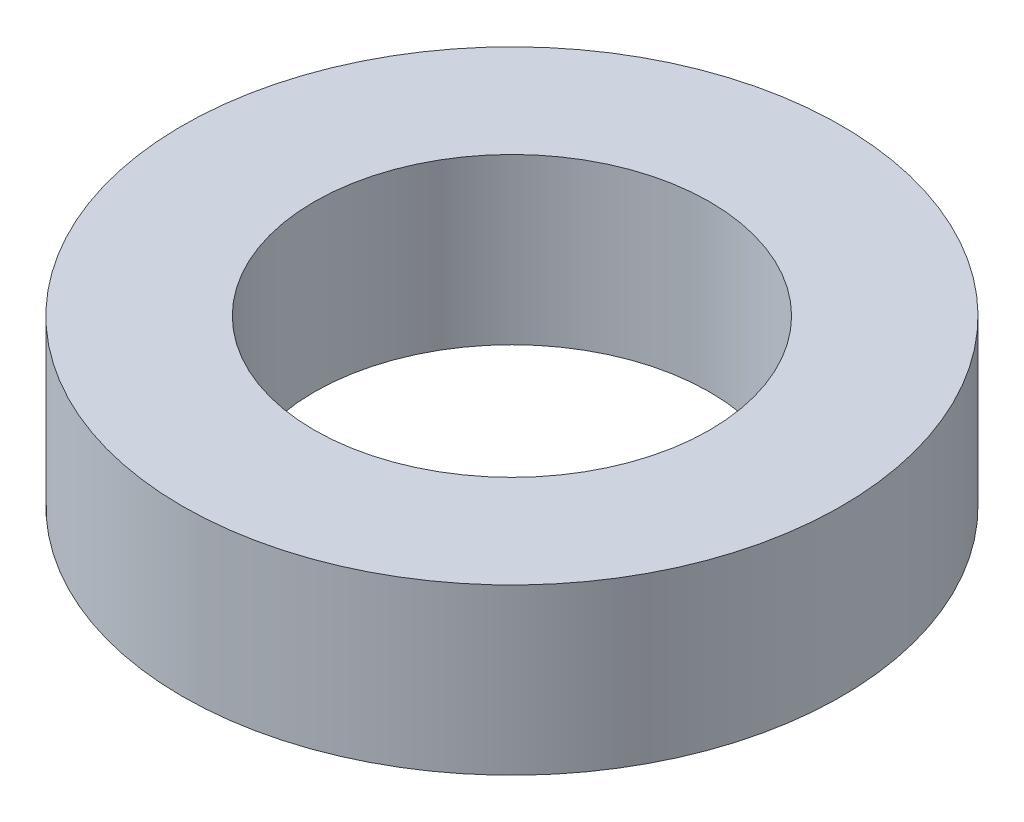
ISO-10303-21;
HEADER;
FILE_DESCRIPTION(('STEP AP214'),'2;1');
FILE_NAME('part.step','',(''),(''),'','','');
FILE_SCHEMA(('AUTOMOTIVE_DESIGN { 1 0 10303 214 1 1 1 1 }'));
ENDSEC;
DATA;
#1=APPLICATION_CONTEXT('core data for automotive mechanical design processes');
#2=APPLICATION_PROTOCOL_DEFINITION('international standard','automotive_design',2000,#1);
#3=PRODUCT_CONTEXT('',#1,'mechanical');
#4=PRODUCT('Part','Part','',(#3));
#5=PRODUCT_RELATED_PRODUCT_CATEGORY('part','',(#4));
#6=PRODUCT_DEFINITION_FORMATION('','',#4);
#7=PRODUCT_DEFINITION_CONTEXT('part definition',#1,'design');
#8=PRODUCT_DEFINITION('design','',#6,#7);
#9=PRODUCT_DEFINITION_SHAPE('','',#8);
#10=(LENGTH_UNIT() NAMED_UNIT(*) SI_UNIT(.MILLI.,.METRE.));
#11=(NAMED_UNIT(*) PLANE_ANGLE_UNIT() SI_UNIT($,.RADIAN.));
#12=(NAMED_UNIT(*) SI_UNIT($,.STERADIAN.) SOLID_ANGLE_UNIT());
#13=UNCERTAINTY_MEASURE_WITH_UNIT(LENGTH_MEASURE(1.E-05),#10,'distance_accuracy_value','');
#14=(GEOMETRIC_REPRESENTATION_CONTEXT(3) GLOBAL_UNCERTAINTY_ASSIGNED_CONTEXT((#13)) GLOBAL_UNIT_ASSIGNED_CONTEXT((#10,
#11,#12)) REPRESENTATION_CONTEXT('',''));
#15=CARTESIAN_POINT('',(0.,0.,0.));
#16=DIRECTION('',(0.,0.,1.));
#17=DIRECTION('',(1.,0.,0.));
#18=AXIS2_PLACEMENT_3D('',#15,#16,#17);
#19=CARTESIAN_POINT('',(0.,5.,0.));
#20=DIRECTION('',(0.,1.,0.));
#21=DIRECTION('',(0.,0.,1.));
#22=AXIS2_PLACEMENT_3D('',#19,#20,#21);
#23=PLANE('',#22);
#24=CARTESIAN_POINT('',(0.,5.,0.));
#25=DIRECTION('',(0.,1.,0.));
#26=DIRECTION('',(0.,0.,1.));
#27=AXIS2_PLACEMENT_3D('',#24,#25,#26);
#28=CIRCLE('',#27,10.);
#29=CARTESIAN_POINT('',(0.,5.,10.));
#30=VERTEX_POINT('',#29);
#31=EDGE_CURVE('E10',#30,#30,#28,.T.);
#32=ORIENTED_EDGE('',*,*,#31,.T.);
#33=EDGE_LOOP('',(#32));
#34=FACE_BOUND('',#33,.T.);
#35=CARTESIAN_POINT('',(0.,5.,0.));
#36=DIRECTION('',(0.,1.,0.));
#37=DIRECTION('',(0.,0.,1.));
#38=AXIS2_PLACEMENT_3D('',#35,#36,#37);
#39=CIRCLE('',#38,6.);
#40=CARTESIAN_POINT('',(0.,5.,6.));
#41=VERTEX_POINT('',#40);
#42=EDGE_CURVE('E42',#41,#41,#39,.T.);
#43=ORIENTED_EDGE('',*,*,#42,.F.);
#44=EDGE_LOOP('',(#43));
#45=FACE_BOUND('',#44,.T.);
#46=ADVANCED_FACE('F31',(#34,#45),#23,.T.);
#47=CARTESIAN_POINT('',(0.,0.,0.));
#48=DIRECTION('',(0.,1.,0.));
#49=DIRECTION('',(0.,0.,1.));
#50=AXIS2_PLACEMENT_3D('',#47,#48,#49);
#51=PLANE('',#50);
#52=CARTESIAN_POINT('',(0.,0.,0.));
#53=DIRECTION('',(0.,1.,0.));
#54=DIRECTION('',(0.,0.,1.));
#55=AXIS2_PLACEMENT_3D('',#52,#53,#54);
#56=CIRCLE('',#55,10.);
#57=CARTESIAN_POINT('',(0.,0.,10.));
#58=VERTEX_POINT('',#57);
#59=EDGE_CURVE('E35',#58,#58,#56,.T.);
#60=ORIENTED_EDGE('',*,*,#59,.F.);
#61=EDGE_LOOP('',(#60));
#62=FACE_BOUND('',#61,.T.);
#63=CARTESIAN_POINT('',(0.,0.,0.));
#64=DIRECTION('',(0.,1.,0.));
#65=DIRECTION('',(0.,0.,1.));
#66=AXIS2_PLACEMENT_3D('',#63,#64,#65);
#67=CIRCLE('',#66,6.);
#68=CARTESIAN_POINT('',(0.,0.,6.));
#69=VERTEX_POINT('',#68);
#70=EDGE_CURVE('E44',#69,#69,#67,.T.);
#71=ORIENTED_EDGE('',*,*,#70,.T.);
#72=EDGE_LOOP('',(#71));
#73=FACE_BOUND('',#72,.T.);
#74=ADVANCED_FACE('F54',(#62,#73),#51,.F.);
#75=CARTESIAN_POINT('',(0.,5.,0.));
#76=DIRECTION('',(0.,-1.,0.));
#77=DIRECTION('',(0.,0.,-1.));
#78=AXIS2_PLACEMENT_3D('',#75,#76,#77);
#79=CYLINDRICAL_SURFACE('',#78,10.);
#80=ORIENTED_EDGE('',*,*,#31,.F.);
#81=EDGE_LOOP('',(#80));
#82=FACE_BOUND('',#81,.T.);
#83=ORIENTED_EDGE('',*,*,#59,.T.);
#84=EDGE_LOOP('',(#83));
#85=FACE_BOUND('',#84,.T.);
#86=ADVANCED_FACE('F33',(#82,#85),#79,.T.);
#87=CARTESIAN_POINT('',(0.,5.,0.));
#88=DIRECTION('',(0.,-1.,0.));
#89=DIRECTION('',(0.,0.,-1.));
#90=AXIS2_PLACEMENT_3D('',#87,#88,#89);
#91=CYLINDRICAL_SURFACE('',#90,6.);
#92=ORIENTED_EDGE('',*,*,#42,.T.);
#93=EDGE_LOOP('',(#92));
#94=FACE_BOUND('',#93,.T.);
#95=ORIENTED_EDGE('',*,*,#70,.F.);
#96=EDGE_LOOP('',(#95));
#97=FACE_BOUND('',#96,.T.);
#98=ADVANCED_FACE('F50',(#94,#97),#91,.F.);
#99=CLOSED_SHELL('',(#46,#74,#86,#98));
#100=MANIFOLD_SOLID_BREP('B2',#99);
#101=ADVANCED_BREP_SHAPE_REPRESENTATION('',(#18,#100),#14);
#102=SHAPE_DEFINITION_REPRESENTATION(#9,#101);
ENDSEC;
END-ISO-10303-21;
